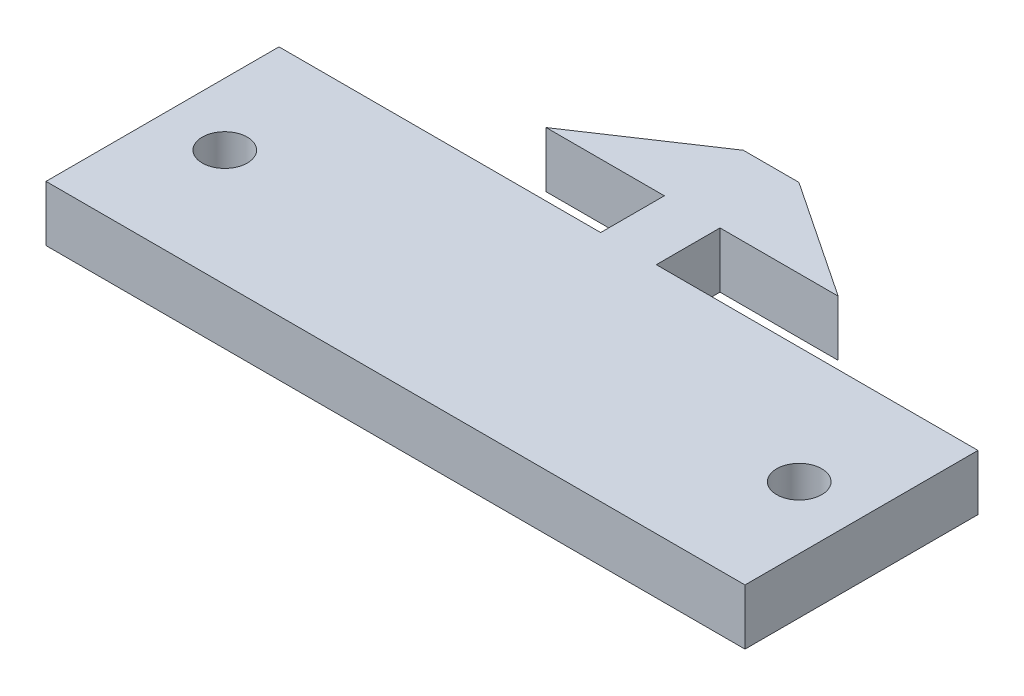
ISO-10303-21;
HEADER;
FILE_DESCRIPTION(('STEP AP214'),'2;1');
FILE_NAME('part.step','',(''),(''),'','','');
FILE_SCHEMA(('AUTOMOTIVE_DESIGN { 1 0 10303 214 1 1 1 1 }'));
ENDSEC;
DATA;
#1=APPLICATION_CONTEXT('core data for automotive mechanical design processes');
#2=APPLICATION_PROTOCOL_DEFINITION('international standard','automotive_design',2000,#1);
#3=PRODUCT_CONTEXT('',#1,'mechanical');
#4=PRODUCT('Part','Part','',(#3));
#5=PRODUCT_RELATED_PRODUCT_CATEGORY('part','',(#4));
#6=PRODUCT_DEFINITION_FORMATION('','',#4);
#7=PRODUCT_DEFINITION_CONTEXT('part definition',#1,'design');
#8=PRODUCT_DEFINITION('design','',#6,#7);
#9=PRODUCT_DEFINITION_SHAPE('','',#8);
#10=(LENGTH_UNIT() NAMED_UNIT(*) SI_UNIT(.MILLI.,.METRE.));
#11=(NAMED_UNIT(*) PLANE_ANGLE_UNIT() SI_UNIT($,.RADIAN.));
#12=(NAMED_UNIT(*) SI_UNIT($,.STERADIAN.) SOLID_ANGLE_UNIT());
#13=UNCERTAINTY_MEASURE_WITH_UNIT(LENGTH_MEASURE(1.E-05),#10,'distance_accuracy_value','');
#14=(GEOMETRIC_REPRESENTATION_CONTEXT(3) GLOBAL_UNCERTAINTY_ASSIGNED_CONTEXT((#13)) GLOBAL_UNIT_ASSIGNED_CONTEXT((#10,
#11,#12)) REPRESENTATION_CONTEXT('',''));
#15=CARTESIAN_POINT('',(0.,0.,0.));
#16=DIRECTION('',(0.,0.,1.));
#17=DIRECTION('',(1.,0.,0.));
#18=AXIS2_PLACEMENT_3D('',#15,#16,#17);
#19=CARTESIAN_POINT('',(0.,3.5814,17.05));
#20=DIRECTION('',(0.,0.,-1.));
#21=DIRECTION('',(-1.,0.,0.));
#22=AXIS2_PLACEMENT_3D('',#19,#20,#21);
#23=PLANE('',#22);
#24=DIRECTION('',(1.,0.,0.));
#25=VECTOR('',#24,1.);
#26=CARTESIAN_POINT('',(0.,0.,17.05));
#27=LINE('',#26,#25);
#28=CARTESIAN_POINT('',(-22.5,0.,17.05));
#29=VERTEX_POINT('',#28);
#30=CARTESIAN_POINT('',(22.5,0.,17.05));
#31=VERTEX_POINT('',#30);
#32=EDGE_CURVE('E158',#29,#31,#27,.T.);
#33=ORIENTED_EDGE('',*,*,#32,.T.);
#34=DIRECTION('',(0.,-1.,0.));
#35=VECTOR('',#34,1.);
#36=CARTESIAN_POINT('',(22.5,3.5814,17.05));
#37=LINE('',#36,#35);
#38=CARTESIAN_POINT('',(22.5,3.5814,17.05));
#39=VERTEX_POINT('',#38);
#40=EDGE_CURVE('E11',#39,#31,#37,.T.);
#41=ORIENTED_EDGE('',*,*,#40,.F.);
#42=DIRECTION('',(1.,0.,0.));
#43=VECTOR('',#42,1.);
#44=CARTESIAN_POINT('',(0.,3.5814,17.05));
#45=LINE('',#44,#43);
#46=CARTESIAN_POINT('',(-22.5,3.5814,17.05));
#47=VERTEX_POINT('',#46);
#48=EDGE_CURVE('E189',#47,#39,#45,.T.);
#49=ORIENTED_EDGE('',*,*,#48,.F.);
#50=DIRECTION('',(0.,-1.,0.));
#51=VECTOR('',#50,1.);
#52=CARTESIAN_POINT('',(-22.5,3.5814,17.05));
#53=LINE('',#52,#51);
#54=EDGE_CURVE('E157',#47,#29,#53,.T.);
#55=ORIENTED_EDGE('',*,*,#54,.T.);
#56=EDGE_LOOP('',(#33,#41,#49,#55));
#57=FACE_BOUND('',#56,.T.);
#58=ADVANCED_FACE('F36',(#57),#23,.F.);
#59=CARTESIAN_POINT('',(22.5,3.5814,0.));
#60=DIRECTION('',(-1.,0.,0.));
#61=DIRECTION('',(0.,0.,1.));
#62=AXIS2_PLACEMENT_3D('',#59,#60,#61);
#63=PLANE('',#62);
#64=DIRECTION('',(0.,0.,-1.));
#65=VECTOR('',#64,1.);
#66=CARTESIAN_POINT('',(22.5,0.,0.));
#67=LINE('',#66,#65);
#68=CARTESIAN_POINT('',(22.5,0.,2.05));
#69=VERTEX_POINT('',#68);
#70=EDGE_CURVE('E161',#31,#69,#67,.T.);
#71=ORIENTED_EDGE('',*,*,#70,.T.);
#72=DIRECTION('',(0.,-1.,0.));
#73=VECTOR('',#72,1.);
#74=CARTESIAN_POINT('',(22.5,3.5814,2.05));
#75=LINE('',#74,#73);
#76=CARTESIAN_POINT('',(22.5,3.5814,2.05));
#77=VERTEX_POINT('',#76);
#78=EDGE_CURVE('E44',#77,#69,#75,.T.);
#79=ORIENTED_EDGE('',*,*,#78,.F.);
#80=DIRECTION('',(0.,0.,-1.));
#81=VECTOR('',#80,1.);
#82=CARTESIAN_POINT('',(22.5,3.5814,0.));
#83=LINE('',#82,#81);
#84=EDGE_CURVE('E106',#39,#77,#83,.T.);
#85=ORIENTED_EDGE('',*,*,#84,.F.);
#86=ORIENTED_EDGE('',*,*,#40,.T.);
#87=EDGE_LOOP('',(#71,#79,#85,#86));
#88=FACE_BOUND('',#87,.T.);
#89=ADVANCED_FACE('F210',(#88),#63,.F.);
#90=CARTESIAN_POINT('',(0.,3.5814,2.05));
#91=DIRECTION('',(0.,0.,-1.));
#92=DIRECTION('',(-1.,0.,0.));
#93=AXIS2_PLACEMENT_3D('',#90,#91,#92);
#94=PLANE('',#93);
#95=DIRECTION('',(1.,0.,0.));
#96=VECTOR('',#95,1.);
#97=CARTESIAN_POINT('',(0.,0.,2.05));
#98=LINE('',#97,#96);
#99=CARTESIAN_POINT('',(1.7907,0.,2.05));
#100=VERTEX_POINT('',#99);
#101=EDGE_CURVE('E165',#100,#69,#98,.T.);
#102=ORIENTED_EDGE('',*,*,#101,.F.);
#103=DIRECTION('',(0.,-1.,0.));
#104=VECTOR('',#103,1.);
#105=CARTESIAN_POINT('',(1.7907,3.5814,2.05));
#106=LINE('',#105,#104);
#107=CARTESIAN_POINT('',(1.7907,3.5814,2.05));
#108=VERTEX_POINT('',#107);
#109=EDGE_CURVE('E203',#108,#100,#106,.T.);
#110=ORIENTED_EDGE('',*,*,#109,.F.);
#111=DIRECTION('',(1.,0.,0.));
#112=VECTOR('',#111,1.);
#113=CARTESIAN_POINT('',(0.,3.5814,2.05));
#114=LINE('',#113,#112);
#115=EDGE_CURVE('E209',#108,#77,#114,.T.);
#116=ORIENTED_EDGE('',*,*,#115,.T.);
#117=ORIENTED_EDGE('',*,*,#78,.T.);
#118=EDGE_LOOP('',(#102,#110,#116,#117));
#119=FACE_BOUND('',#118,.T.);
#120=ADVANCED_FACE('F207',(#119),#94,.T.);
#121=CARTESIAN_POINT('',(1.7907,3.5814,0.));
#122=DIRECTION('',(-1.,0.,0.));
#123=DIRECTION('',(0.,0.,1.));
#124=AXIS2_PLACEMENT_3D('',#121,#122,#123);
#125=PLANE('',#124);
#126=DIRECTION('',(0.,0.,-1.));
#127=VECTOR('',#126,1.);
#128=CARTESIAN_POINT('',(1.7907,0.,0.));
#129=LINE('',#128,#127);
#130=CARTESIAN_POINT('',(1.7907,0.,-2.05));
#131=VERTEX_POINT('',#130);
#132=EDGE_CURVE('E168',#100,#131,#129,.T.);
#133=ORIENTED_EDGE('',*,*,#132,.T.);
#134=DIRECTION('',(0.,-1.,0.));
#135=VECTOR('',#134,1.);
#136=CARTESIAN_POINT('',(1.7907,3.5814,-2.05));
#137=LINE('',#136,#135);
#138=CARTESIAN_POINT('',(1.7907,3.5814,-2.05));
#139=VERTEX_POINT('',#138);
#140=EDGE_CURVE('E201',#139,#131,#137,.T.);
#141=ORIENTED_EDGE('',*,*,#140,.F.);
#142=DIRECTION('',(0.,0.,-1.));
#143=VECTOR('',#142,1.);
#144=CARTESIAN_POINT('',(1.7907,3.5814,0.));
#145=LINE('',#144,#143);
#146=EDGE_CURVE('E222',#108,#139,#145,.T.);
#147=ORIENTED_EDGE('',*,*,#146,.F.);
#148=ORIENTED_EDGE('',*,*,#109,.T.);
#149=EDGE_LOOP('',(#133,#141,#147,#148));
#150=FACE_BOUND('',#149,.T.);
#151=ADVANCED_FACE('F219',(#150),#125,.F.);
#152=CARTESIAN_POINT('',(0.,3.5814,-2.05));
#153=DIRECTION('',(0.,0.,1.));
#154=DIRECTION('',(1.,0.,0.));
#155=AXIS2_PLACEMENT_3D('',#152,#153,#154);
#156=PLANE('',#155);
#157=DIRECTION('',(-1.,0.,0.));
#158=VECTOR('',#157,1.);
#159=CARTESIAN_POINT('',(0.,0.,-2.05));
#160=LINE('',#159,#158);
#161=CARTESIAN_POINT('',(9.398,0.,-2.05));
#162=VERTEX_POINT('',#161);
#163=EDGE_CURVE('E171',#162,#131,#160,.T.);
#164=ORIENTED_EDGE('',*,*,#163,.F.);
#165=DIRECTION('',(0.,-1.,0.));
#166=VECTOR('',#165,1.);
#167=CARTESIAN_POINT('',(9.398,3.5814,-2.05));
#168=LINE('',#167,#166);
#169=CARTESIAN_POINT('',(9.398,3.5814,-2.05));
#170=VERTEX_POINT('',#169);
#171=EDGE_CURVE('E199',#170,#162,#168,.T.);
#172=ORIENTED_EDGE('',*,*,#171,.F.);
#173=DIRECTION('',(-1.,0.,0.));
#174=VECTOR('',#173,1.);
#175=CARTESIAN_POINT('',(0.,3.5814,-2.05));
#176=LINE('',#175,#174);
#177=EDGE_CURVE('E224',#170,#139,#176,.T.);
#178=ORIENTED_EDGE('',*,*,#177,.T.);
#179=ORIENTED_EDGE('',*,*,#140,.T.);
#180=EDGE_LOOP('',(#164,#172,#178,#179));
#181=FACE_BOUND('',#180,.T.);
#182=ADVANCED_FACE('F270',(#181),#156,.T.);
#183=CARTESIAN_POINT('',(3.84513522525978,3.5814,-5.75808999982652));
#184=DIRECTION('',(0.555340809590661,0.,-0.831622862362014));
#185=DIRECTION('',(-0.831622862362014,0.,-0.555340809590661));
#186=AXIS2_PLACEMENT_3D('',#183,#184,#185);
#187=PLANE('',#186);
#188=DIRECTION('',(0.831622862362014,0.,0.555340809590661));
#189=VECTOR('',#188,1.);
#190=CARTESIAN_POINT('',(3.84513522525978,0.,-5.75808999982652));
#191=LINE('',#190,#189);
#192=CARTESIAN_POINT('',(1.7907,0.,-7.13));
#193=VERTEX_POINT('',#192);
#194=EDGE_CURVE('E174',#193,#162,#191,.T.);
#195=ORIENTED_EDGE('',*,*,#194,.F.);
#196=DIRECTION('',(0.,-1.,0.));
#197=VECTOR('',#196,1.);
#198=CARTESIAN_POINT('',(1.7907,3.5814,-7.13));
#199=LINE('',#198,#197);
#200=CARTESIAN_POINT('',(1.7907,3.5814,-7.13));
#201=VERTEX_POINT('',#200);
#202=EDGE_CURVE('E197',#201,#193,#199,.T.);
#203=ORIENTED_EDGE('',*,*,#202,.F.);
#204=DIRECTION('',(0.831622862362014,0.,0.555340809590661));
#205=VECTOR('',#204,1.);
#206=CARTESIAN_POINT('',(3.84513522525978,3.5814,-5.75808999982652));
#207=LINE('',#206,#205);
#208=EDGE_CURVE('E231',#201,#170,#207,.T.);
#209=ORIENTED_EDGE('',*,*,#208,.T.);
#210=ORIENTED_EDGE('',*,*,#171,.T.);
#211=EDGE_LOOP('',(#195,#203,#209,#210));
#212=FACE_BOUND('',#211,.T.);
#213=ADVANCED_FACE('F273',(#212),#187,.T.);
#214=CARTESIAN_POINT('',(0.,3.5814,-7.13));
#215=DIRECTION('',(0.,0.,-1.));
#216=DIRECTION('',(-1.,0.,0.));
#217=AXIS2_PLACEMENT_3D('',#214,#215,#216);
#218=PLANE('',#217);
#219=DIRECTION('',(1.,0.,0.));
#220=VECTOR('',#219,1.);
#221=CARTESIAN_POINT('',(0.,0.,-7.13));
#222=LINE('',#221,#220);
#223=CARTESIAN_POINT('',(-1.7907,0.,-7.13));
#224=VERTEX_POINT('',#223);
#225=EDGE_CURVE('E177',#224,#193,#222,.T.);
#226=ORIENTED_EDGE('',*,*,#225,.F.);
#227=DIRECTION('',(0.,-1.,0.));
#228=VECTOR('',#227,1.);
#229=CARTESIAN_POINT('',(-1.7907,3.5814,-7.13));
#230=LINE('',#229,#228);
#231=CARTESIAN_POINT('',(-1.7907,3.5814,-7.13));
#232=VERTEX_POINT('',#231);
#233=EDGE_CURVE('E195',#232,#224,#230,.T.);
#234=ORIENTED_EDGE('',*,*,#233,.F.);
#235=DIRECTION('',(1.,0.,0.));
#236=VECTOR('',#235,1.);
#237=CARTESIAN_POINT('',(0.,3.5814,-7.13));
#238=LINE('',#237,#236);
#239=EDGE_CURVE('E234',#232,#201,#238,.T.);
#240=ORIENTED_EDGE('',*,*,#239,.T.);
#241=ORIENTED_EDGE('',*,*,#202,.T.);
#242=EDGE_LOOP('',(#226,#234,#240,#241));
#243=FACE_BOUND('',#242,.T.);
#244=ADVANCED_FACE('F277',(#243),#218,.T.);
#245=CARTESIAN_POINT('',(-3.84513522525978,3.5814,-5.75808999982652));
#246=DIRECTION('',(-0.555340809590661,0.,-0.831622862362014));
#247=DIRECTION('',(-0.831622862362014,0.,0.555340809590661));
#248=AXIS2_PLACEMENT_3D('',#245,#246,#247);
#249=PLANE('',#248);
#250=DIRECTION('',(0.831622862362014,0.,-0.555340809590661));
#251=VECTOR('',#250,1.);
#252=CARTESIAN_POINT('',(-3.84513522525978,0.,-5.75808999982652));
#253=LINE('',#252,#251);
#254=CARTESIAN_POINT('',(-9.398,0.,-2.05));
#255=VERTEX_POINT('',#254);
#256=EDGE_CURVE('E180',#255,#224,#253,.T.);
#257=ORIENTED_EDGE('',*,*,#256,.F.);
#258=DIRECTION('',(0.,-1.,0.));
#259=VECTOR('',#258,1.);
#260=CARTESIAN_POINT('',(-9.398,3.5814,-2.05));
#261=LINE('',#260,#259);
#262=CARTESIAN_POINT('',(-9.398,3.5814,-2.05));
#263=VERTEX_POINT('',#262);
#264=EDGE_CURVE('E193',#263,#255,#261,.T.);
#265=ORIENTED_EDGE('',*,*,#264,.F.);
#266=DIRECTION('',(0.831622862362014,0.,-0.555340809590661));
#267=VECTOR('',#266,1.);
#268=CARTESIAN_POINT('',(-3.84513522525978,3.5814,-5.75808999982652));
#269=LINE('',#268,#267);
#270=EDGE_CURVE('E152',#263,#232,#269,.T.);
#271=ORIENTED_EDGE('',*,*,#270,.T.);
#272=ORIENTED_EDGE('',*,*,#233,.T.);
#273=EDGE_LOOP('',(#257,#265,#271,#272));
#274=FACE_BOUND('',#273,.T.);
#275=ADVANCED_FACE('F239',(#274),#249,.T.);
#276=CARTESIAN_POINT('',(0.,3.5814,-2.05));
#277=DIRECTION('',(0.,0.,1.));
#278=DIRECTION('',(1.,0.,0.));
#279=AXIS2_PLACEMENT_3D('',#276,#277,#278);
#280=PLANE('',#279);
#281=DIRECTION('',(-1.,0.,0.));
#282=VECTOR('',#281,1.);
#283=CARTESIAN_POINT('',(0.,0.,-2.05));
#284=LINE('',#283,#282);
#285=CARTESIAN_POINT('',(-1.7907,0.,-2.05));
#286=VERTEX_POINT('',#285);
#287=EDGE_CURVE('E183',#286,#255,#284,.T.);
#288=ORIENTED_EDGE('',*,*,#287,.F.);
#289=DIRECTION('',(0.,-1.,0.));
#290=VECTOR('',#289,1.);
#291=CARTESIAN_POINT('',(-1.7907,3.5814,-2.05));
#292=LINE('',#291,#290);
#293=CARTESIAN_POINT('',(-1.7907,3.5814,-2.05));
#294=VERTEX_POINT('',#293);
#295=EDGE_CURVE('E140',#294,#286,#292,.T.);
#296=ORIENTED_EDGE('',*,*,#295,.F.);
#297=DIRECTION('',(-1.,0.,0.));
#298=VECTOR('',#297,1.);
#299=CARTESIAN_POINT('',(0.,3.5814,-2.05));
#300=LINE('',#299,#298);
#301=EDGE_CURVE('E150',#294,#263,#300,.T.);
#302=ORIENTED_EDGE('',*,*,#301,.T.);
#303=ORIENTED_EDGE('',*,*,#264,.T.);
#304=EDGE_LOOP('',(#288,#296,#302,#303));
#305=FACE_BOUND('',#304,.T.);
#306=ADVANCED_FACE('F245',(#305),#280,.T.);
#307=CARTESIAN_POINT('',(-1.7907,3.5814,0.));
#308=DIRECTION('',(-1.,0.,0.));
#309=DIRECTION('',(0.,0.,1.));
#310=AXIS2_PLACEMENT_3D('',#307,#308,#309);
#311=PLANE('',#310);
#312=DIRECTION('',(0.,0.,-1.));
#313=VECTOR('',#312,1.);
#314=CARTESIAN_POINT('',(-1.7907,0.,0.));
#315=LINE('',#314,#313);
#316=CARTESIAN_POINT('',(-1.7907,0.,2.05));
#317=VERTEX_POINT('',#316);
#318=EDGE_CURVE('E139',#317,#286,#315,.T.);
#319=ORIENTED_EDGE('',*,*,#318,.F.);
#320=DIRECTION('',(0.,-1.,0.));
#321=VECTOR('',#320,1.);
#322=CARTESIAN_POINT('',(-1.7907,3.5814,2.05));
#323=LINE('',#322,#321);
#324=CARTESIAN_POINT('',(-1.7907,3.5814,2.05));
#325=VERTEX_POINT('',#324);
#326=EDGE_CURVE('E133',#325,#317,#323,.T.);
#327=ORIENTED_EDGE('',*,*,#326,.F.);
#328=DIRECTION('',(0.,0.,-1.));
#329=VECTOR('',#328,1.);
#330=CARTESIAN_POINT('',(-1.7907,3.5814,0.));
#331=LINE('',#330,#329);
#332=EDGE_CURVE('E137',#325,#294,#331,.T.);
#333=ORIENTED_EDGE('',*,*,#332,.T.);
#334=ORIENTED_EDGE('',*,*,#295,.T.);
#335=EDGE_LOOP('',(#319,#327,#333,#334));
#336=FACE_BOUND('',#335,.T.);
#337=ADVANCED_FACE('F135',(#336),#311,.T.);
#338=CARTESIAN_POINT('',(0.,3.5814,2.05));
#339=DIRECTION('',(0.,0.,1.));
#340=DIRECTION('',(1.,0.,0.));
#341=AXIS2_PLACEMENT_3D('',#338,#339,#340);
#342=PLANE('',#341);
#343=DIRECTION('',(-1.,0.,0.));
#344=VECTOR('',#343,1.);
#345=CARTESIAN_POINT('',(0.,0.,2.05));
#346=LINE('',#345,#344);
#347=CARTESIAN_POINT('',(-22.5,0.,2.05));
#348=VERTEX_POINT('',#347);
#349=EDGE_CURVE('E92',#317,#348,#346,.T.);
#350=ORIENTED_EDGE('',*,*,#349,.T.);
#351=DIRECTION('',(0.,-1.,0.));
#352=VECTOR('',#351,1.);
#353=CARTESIAN_POINT('',(-22.5,3.5814,2.05));
#354=LINE('',#353,#352);
#355=CARTESIAN_POINT('',(-22.5,3.5814,2.05));
#356=VERTEX_POINT('',#355);
#357=EDGE_CURVE('E141',#356,#348,#354,.T.);
#358=ORIENTED_EDGE('',*,*,#357,.F.);
#359=DIRECTION('',(-1.,0.,0.));
#360=VECTOR('',#359,1.);
#361=CARTESIAN_POINT('',(0.,3.5814,2.05));
#362=LINE('',#361,#360);
#363=EDGE_CURVE('E143',#325,#356,#362,.T.);
#364=ORIENTED_EDGE('',*,*,#363,.F.);
#365=ORIENTED_EDGE('',*,*,#326,.T.);
#366=EDGE_LOOP('',(#350,#358,#364,#365));
#367=FACE_BOUND('',#366,.T.);
#368=ADVANCED_FACE('F144',(#367),#342,.F.);
#369=CARTESIAN_POINT('',(-22.5,3.5814,0.));
#370=DIRECTION('',(1.,0.,0.));
#371=DIRECTION('',(0.,0.,-1.));
#372=AXIS2_PLACEMENT_3D('',#369,#370,#371);
#373=PLANE('',#372);
#374=DIRECTION('',(0.,0.,1.));
#375=VECTOR('',#374,1.);
#376=CARTESIAN_POINT('',(-22.5,0.,0.));
#377=LINE('',#376,#375);
#378=EDGE_CURVE('E98',#348,#29,#377,.T.);
#379=ORIENTED_EDGE('',*,*,#378,.T.);
#380=ORIENTED_EDGE('',*,*,#54,.F.);
#381=DIRECTION('',(0.,0.,1.));
#382=VECTOR('',#381,1.);
#383=CARTESIAN_POINT('',(-22.5,3.5814,0.));
#384=LINE('',#383,#382);
#385=EDGE_CURVE('E52',#356,#47,#384,.T.);
#386=ORIENTED_EDGE('',*,*,#385,.F.);
#387=ORIENTED_EDGE('',*,*,#357,.T.);
#388=EDGE_LOOP('',(#379,#380,#386,#387));
#389=FACE_BOUND('',#388,.T.);
#390=ADVANCED_FACE('F248',(#389),#373,.F.);
#391=CARTESIAN_POINT('',(0.,3.5814,0.));
#392=DIRECTION('',(0.,1.,0.));
#393=DIRECTION('',(0.,0.,1.));
#394=AXIS2_PLACEMENT_3D('',#391,#392,#393);
#395=PLANE('',#394);
#396=CARTESIAN_POINT('',(-18.49,3.5814,9.55));
#397=DIRECTION('',(0.,1.,0.));
#398=DIRECTION('',(0.,0.,1.));
#399=AXIS2_PLACEMENT_3D('',#396,#397,#398);
#400=CIRCLE('',#399,1.45);
#401=CARTESIAN_POINT('',(-18.49,3.5814,11.));
#402=VERTEX_POINT('',#401);
#403=EDGE_CURVE('E342',#402,#402,#400,.T.);
#404=ORIENTED_EDGE('',*,*,#403,.F.);
#405=EDGE_LOOP('',(#404));
#406=FACE_BOUND('',#405,.T.);
#407=CARTESIAN_POINT('',(18.49,3.5814,9.54999999999999));
#408=DIRECTION('',(0.,1.,0.));
#409=DIRECTION('',(0.,0.,1.));
#410=AXIS2_PLACEMENT_3D('',#407,#408,#409);
#411=CIRCLE('',#410,1.45);
#412=CARTESIAN_POINT('',(18.49,3.5814,11.));
#413=VERTEX_POINT('',#412);
#414=EDGE_CURVE('E347',#413,#413,#411,.T.);
#415=ORIENTED_EDGE('',*,*,#414,.F.);
#416=EDGE_LOOP('',(#415));
#417=FACE_BOUND('',#416,.T.);
#418=ORIENTED_EDGE('',*,*,#48,.T.);
#419=ORIENTED_EDGE('',*,*,#84,.T.);
#420=ORIENTED_EDGE('',*,*,#115,.F.);
#421=ORIENTED_EDGE('',*,*,#146,.T.);
#422=ORIENTED_EDGE('',*,*,#177,.F.);
#423=ORIENTED_EDGE('',*,*,#208,.F.);
#424=ORIENTED_EDGE('',*,*,#239,.F.);
#425=ORIENTED_EDGE('',*,*,#270,.F.);
#426=ORIENTED_EDGE('',*,*,#301,.F.);
#427=ORIENTED_EDGE('',*,*,#332,.F.);
#428=ORIENTED_EDGE('',*,*,#363,.T.);
#429=ORIENTED_EDGE('',*,*,#385,.T.);
#430=EDGE_LOOP('',(#418,#419,#420,#421,#422,#423,#424,#425,#426,#427,#428,#429));
#431=FACE_BOUND('',#430,.T.);
#432=ADVANCED_FACE('F147',(#406,#417,#431),#395,.T.);
#433=CARTESIAN_POINT('',(0.,0.,0.));
#434=DIRECTION('',(0.,1.,0.));
#435=DIRECTION('',(0.,0.,1.));
#436=AXIS2_PLACEMENT_3D('',#433,#434,#435);
#437=PLANE('',#436);
#438=CARTESIAN_POINT('',(-18.49,0.,9.55));
#439=DIRECTION('',(0.,1.,0.));
#440=DIRECTION('',(0.,0.,1.));
#441=AXIS2_PLACEMENT_3D('',#438,#439,#440);
#442=CIRCLE('',#441,1.45);
#443=CARTESIAN_POINT('',(-18.49,0.,11.));
#444=VERTEX_POINT('',#443);
#445=EDGE_CURVE('E162',#444,#444,#442,.T.);
#446=ORIENTED_EDGE('',*,*,#445,.T.);
#447=EDGE_LOOP('',(#446));
#448=FACE_BOUND('',#447,.T.);
#449=CARTESIAN_POINT('',(18.49,0.,9.54999999999999));
#450=DIRECTION('',(0.,1.,0.));
#451=DIRECTION('',(0.,0.,1.));
#452=AXIS2_PLACEMENT_3D('',#449,#450,#451);
#453=CIRCLE('',#452,1.45);
#454=CARTESIAN_POINT('',(18.49,0.,11.));
#455=VERTEX_POINT('',#454);
#456=EDGE_CURVE('E343',#455,#455,#453,.T.);
#457=ORIENTED_EDGE('',*,*,#456,.T.);
#458=EDGE_LOOP('',(#457));
#459=FACE_BOUND('',#458,.T.);
#460=ORIENTED_EDGE('',*,*,#32,.F.);
#461=ORIENTED_EDGE('',*,*,#378,.F.);
#462=ORIENTED_EDGE('',*,*,#349,.F.);
#463=ORIENTED_EDGE('',*,*,#318,.T.);
#464=ORIENTED_EDGE('',*,*,#287,.T.);
#465=ORIENTED_EDGE('',*,*,#256,.T.);
#466=ORIENTED_EDGE('',*,*,#225,.T.);
#467=ORIENTED_EDGE('',*,*,#194,.T.);
#468=ORIENTED_EDGE('',*,*,#163,.T.);
#469=ORIENTED_EDGE('',*,*,#132,.F.);
#470=ORIENTED_EDGE('',*,*,#101,.T.);
#471=ORIENTED_EDGE('',*,*,#70,.F.);
#472=EDGE_LOOP('',(#460,#461,#462,#463,#464,#465,#466,#467,#468,#469,#470,#471));
#473=FACE_BOUND('',#472,.T.);
#474=ADVANCED_FACE('F215',(#448,#459,#473),#437,.F.);
#475=CARTESIAN_POINT('',(18.49,0.,9.54999999999999));
#476=DIRECTION('',(0.,1.,0.));
#477=DIRECTION('',(0.,0.,1.));
#478=AXIS2_PLACEMENT_3D('',#475,#476,#477);
#479=CYLINDRICAL_SURFACE('',#478,1.45);
#480=ORIENTED_EDGE('',*,*,#456,.F.);
#481=EDGE_LOOP('',(#480));
#482=FACE_BOUND('',#481,.T.);
#483=ORIENTED_EDGE('',*,*,#414,.T.);
#484=EDGE_LOOP('',(#483));
#485=FACE_BOUND('',#484,.T.);
#486=ADVANCED_FACE('F314',(#482,#485),#479,.F.);
#487=CARTESIAN_POINT('',(-18.49,0.,9.55));
#488=DIRECTION('',(0.,1.,0.));
#489=DIRECTION('',(0.,0.,1.));
#490=AXIS2_PLACEMENT_3D('',#487,#488,#489);
#491=CYLINDRICAL_SURFACE('',#490,1.45);
#492=ORIENTED_EDGE('',*,*,#445,.F.);
#493=EDGE_LOOP('',(#492));
#494=FACE_BOUND('',#493,.T.);
#495=ORIENTED_EDGE('',*,*,#403,.T.);
#496=EDGE_LOOP('',(#495));
#497=FACE_BOUND('',#496,.T.);
#498=ADVANCED_FACE('F323',(#494,#497),#491,.F.);
#499=CLOSED_SHELL('',(#58,#89,#120,#151,#182,#213,#244,#275,#306,#337,#368,#390,#432,#474,#486,#498));
#500=MANIFOLD_SOLID_BREP('B2',#499);
#501=ADVANCED_BREP_SHAPE_REPRESENTATION('',(#18,#500),#14);
#502=SHAPE_DEFINITION_REPRESENTATION(#9,#501);
ENDSEC;
END-ISO-10303-21;
